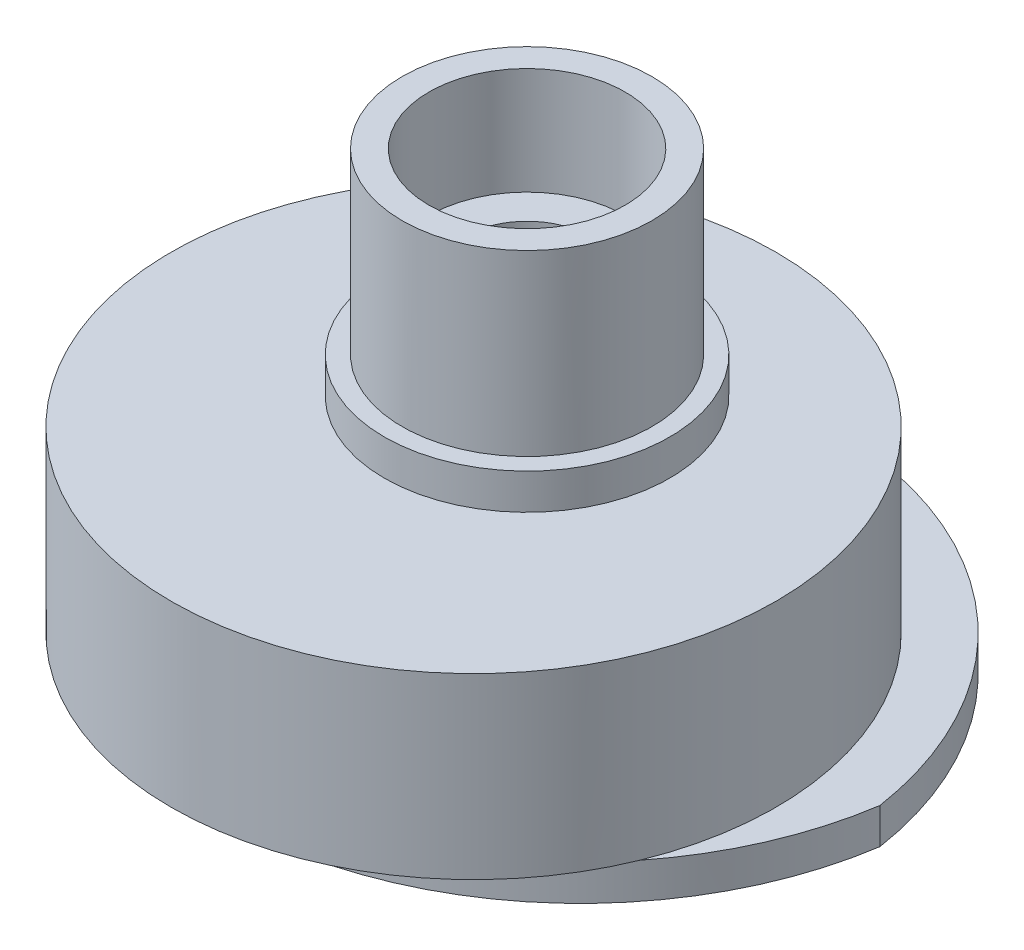
ISO-10303-21;
HEADER;
FILE_DESCRIPTION(('STEP AP214'),'2;1');
FILE_NAME('part.step','',(''),(''),'','','');
FILE_SCHEMA(('AUTOMOTIVE_DESIGN { 1 0 10303 214 1 1 1 1 }'));
ENDSEC;
DATA;
#1=APPLICATION_CONTEXT('core data for automotive mechanical design processes');
#2=APPLICATION_PROTOCOL_DEFINITION('international standard','automotive_design',2000,#1);
#3=PRODUCT_CONTEXT('',#1,'mechanical');
#4=PRODUCT('Part','Part','',(#3));
#5=PRODUCT_RELATED_PRODUCT_CATEGORY('part','',(#4));
#6=PRODUCT_DEFINITION_FORMATION('','',#4);
#7=PRODUCT_DEFINITION_CONTEXT('part definition',#1,'design');
#8=PRODUCT_DEFINITION('design','',#6,#7);
#9=PRODUCT_DEFINITION_SHAPE('','',#8);
#10=(LENGTH_UNIT() NAMED_UNIT(*) SI_UNIT(.MILLI.,.METRE.));
#11=(NAMED_UNIT(*) PLANE_ANGLE_UNIT() SI_UNIT($,.RADIAN.));
#12=(NAMED_UNIT(*) SI_UNIT($,.STERADIAN.) SOLID_ANGLE_UNIT());
#13=UNCERTAINTY_MEASURE_WITH_UNIT(LENGTH_MEASURE(1.E-05),#10,'distance_accuracy_value','');
#14=(GEOMETRIC_REPRESENTATION_CONTEXT(3) GLOBAL_UNCERTAINTY_ASSIGNED_CONTEXT((#13)) GLOBAL_UNIT_ASSIGNED_CONTEXT((#10,
#11,#12)) REPRESENTATION_CONTEXT('',''));
#15=CARTESIAN_POINT('',(0.,0.,0.));
#16=DIRECTION('',(0.,0.,1.));
#17=DIRECTION('',(1.,0.,0.));
#18=AXIS2_PLACEMENT_3D('',#15,#16,#17);
#19=CARTESIAN_POINT('',(0.,3.,0.));
#20=DIRECTION('',(0.,1.,0.));
#21=DIRECTION('',(0.,0.,1.));
#22=AXIS2_PLACEMENT_3D('',#19,#20,#21);
#23=PLANE('',#22);
#24=CARTESIAN_POINT('',(0.,3.,0.));
#25=DIRECTION('',(0.,1.,0.));
#26=DIRECTION('',(0.,0.,1.));
#27=AXIS2_PLACEMENT_3D('',#24,#25,#26);
#28=CIRCLE('',#27,3.5);
#29=CARTESIAN_POINT('',(0.,3.,3.5));
#30=VERTEX_POINT('',#29);
#31=EDGE_CURVE('E46',#30,#30,#28,.T.);
#32=ORIENTED_EDGE('',*,*,#31,.T.);
#33=EDGE_LOOP('',(#32));
#34=FACE_BOUND('',#33,.T.);
#35=CARTESIAN_POINT('',(0.,3.,0.));
#36=DIRECTION('',(0.,1.,0.));
#37=DIRECTION('',(0.,0.,1.));
#38=AXIS2_PLACEMENT_3D('',#35,#36,#37);
#39=CIRCLE('',#38,2.75);
#40=CARTESIAN_POINT('',(0.,3.,2.75));
#41=VERTEX_POINT('',#40);
#42=EDGE_CURVE('E170',#41,#41,#39,.T.);
#43=ORIENTED_EDGE('',*,*,#42,.F.);
#44=EDGE_LOOP('',(#43));
#45=FACE_BOUND('',#44,.T.);
#46=ADVANCED_FACE('F37',(#34,#45),#23,.T.);
#47=CARTESIAN_POINT('',(0.,3.,0.));
#48=DIRECTION('',(0.,-1.,0.));
#49=DIRECTION('',(0.,0.,-1.));
#50=AXIS2_PLACEMENT_3D('',#47,#48,#49);
#51=CYLINDRICAL_SURFACE('',#50,3.5);
#52=ORIENTED_EDGE('',*,*,#31,.F.);
#53=EDGE_LOOP('',(#52));
#54=FACE_BOUND('',#53,.T.);
#55=CARTESIAN_POINT('',(0.,-2.,0.));
#56=DIRECTION('',(0.,-1.,0.));
#57=DIRECTION('',(0.,0.,-1.));
#58=AXIS2_PLACEMENT_3D('',#55,#56,#57);
#59=CIRCLE('',#58,3.5);
#60=CARTESIAN_POINT('',(0.,-2.,-3.5));
#61=VERTEX_POINT('',#60);
#62=EDGE_CURVE('E166',#61,#61,#59,.T.);
#63=ORIENTED_EDGE('',*,*,#62,.F.);
#64=EDGE_LOOP('',(#63));
#65=FACE_BOUND('',#64,.T.);
#66=ADVANCED_FACE('F39',(#54,#65),#51,.T.);
#67=CARTESIAN_POINT('',(0.,3.,0.));
#68=DIRECTION('',(0.,-1.,0.));
#69=DIRECTION('',(0.,0.,-1.));
#70=AXIS2_PLACEMENT_3D('',#67,#68,#69);
#71=CYLINDRICAL_SURFACE('',#70,2.75);
#72=ORIENTED_EDGE('',*,*,#42,.T.);
#73=EDGE_LOOP('',(#72));
#74=FACE_BOUND('',#73,.T.);
#75=CARTESIAN_POINT('',(0.,0.,0.));
#76=DIRECTION('',(0.,1.,0.));
#77=DIRECTION('',(0.,0.,1.));
#78=AXIS2_PLACEMENT_3D('',#75,#76,#77);
#79=CIRCLE('',#78,2.75);
#80=CARTESIAN_POINT('',(0.,0.,2.75));
#81=VERTEX_POINT('',#80);
#82=EDGE_CURVE('E169',#81,#81,#79,.T.);
#83=ORIENTED_EDGE('',*,*,#82,.F.);
#84=EDGE_LOOP('',(#83));
#85=FACE_BOUND('',#84,.T.);
#86=ADVANCED_FACE('F181',(#74,#85),#71,.F.);
#87=CARTESIAN_POINT('',(0.,0.,0.));
#88=DIRECTION('',(0.,-1.,0.));
#89=DIRECTION('',(0.,0.,-1.));
#90=AXIS2_PLACEMENT_3D('',#87,#88,#89);
#91=PLANE('',#90);
#92=CARTESIAN_POINT('',(0.,0.,0.));
#93=DIRECTION('',(0.,-1.,0.));
#94=DIRECTION('',(0.,0.,-1.));
#95=AXIS2_PLACEMENT_3D('',#92,#93,#94);
#96=CIRCLE('',#95,1.75);
#97=CARTESIAN_POINT('',(0.,0.,-1.75));
#98=VERTEX_POINT('',#97);
#99=EDGE_CURVE('E161',#98,#98,#96,.T.);
#100=ORIENTED_EDGE('',*,*,#99,.T.);
#101=EDGE_LOOP('',(#100));
#102=FACE_BOUND('',#101,.T.);
#103=ORIENTED_EDGE('',*,*,#82,.T.);
#104=EDGE_LOOP('',(#103));
#105=FACE_BOUND('',#104,.T.);
#106=ADVANCED_FACE('F209',(#102,#105),#91,.F.);
#107=CARTESIAN_POINT('',(0.,-2.,0.));
#108=DIRECTION('',(0.,1.,0.));
#109=DIRECTION('',(0.,0.,1.));
#110=AXIS2_PLACEMENT_3D('',#107,#108,#109);
#111=CYLINDRICAL_SURFACE('',#110,1.75);
#112=CARTESIAN_POINT('',(0.,-4.,0.));
#113=DIRECTION('',(0.,1.,0.));
#114=DIRECTION('',(0.,0.,1.));
#115=AXIS2_PLACEMENT_3D('',#112,#113,#114);
#116=CIRCLE('',#115,1.75);
#117=CARTESIAN_POINT('',(0.,-4.,1.75));
#118=VERTEX_POINT('',#117);
#119=EDGE_CURVE('E41',#118,#118,#116,.T.);
#120=ORIENTED_EDGE('',*,*,#119,.F.);
#121=EDGE_LOOP('',(#120));
#122=FACE_BOUND('',#121,.T.);
#123=ORIENTED_EDGE('',*,*,#99,.F.);
#124=EDGE_LOOP('',(#123));
#125=FACE_BOUND('',#124,.T.);
#126=ADVANCED_FACE('F188',(#122,#125),#111,.F.);
#127=CARTESIAN_POINT('',(0.,-2.,0.));
#128=DIRECTION('',(0.,-1.,0.));
#129=DIRECTION('',(0.,0.,-1.));
#130=AXIS2_PLACEMENT_3D('',#127,#128,#129);
#131=PLANE('',#130);
#132=ORIENTED_EDGE('',*,*,#62,.T.);
#133=EDGE_LOOP('',(#132));
#134=FACE_BOUND('',#133,.T.);
#135=CARTESIAN_POINT('',(0.,-2.,0.));
#136=DIRECTION('',(0.,-1.,0.));
#137=DIRECTION('',(0.,0.,-1.));
#138=AXIS2_PLACEMENT_3D('',#135,#136,#137);
#139=CIRCLE('',#138,4.);
#140=CARTESIAN_POINT('',(0.,-2.,-4.));
#141=VERTEX_POINT('',#140);
#142=EDGE_CURVE('E154',#141,#141,#139,.T.);
#143=ORIENTED_EDGE('',*,*,#142,.F.);
#144=EDGE_LOOP('',(#143));
#145=FACE_BOUND('',#144,.T.);
#146=ADVANCED_FACE('F184',(#134,#145),#131,.F.);
#147=CARTESIAN_POINT('',(0.,-3.,0.));
#148=DIRECTION('',(0.,1.,0.));
#149=DIRECTION('',(0.,0.,1.));
#150=AXIS2_PLACEMENT_3D('',#147,#148,#149);
#151=CYLINDRICAL_SURFACE('',#150,4.);
#152=CARTESIAN_POINT('',(0.,-3.,0.));
#153=DIRECTION('',(0.,-1.,0.));
#154=DIRECTION('',(0.,0.,-1.));
#155=AXIS2_PLACEMENT_3D('',#152,#153,#154);
#156=CIRCLE('',#155,4.);
#157=CARTESIAN_POINT('',(0.,-3.,-4.));
#158=VERTEX_POINT('',#157);
#159=EDGE_CURVE('E158',#158,#158,#156,.T.);
#160=ORIENTED_EDGE('',*,*,#159,.F.);
#161=EDGE_LOOP('',(#160));
#162=FACE_BOUND('',#161,.T.);
#163=ORIENTED_EDGE('',*,*,#142,.T.);
#164=EDGE_LOOP('',(#163));
#165=FACE_BOUND('',#164,.T.);
#166=ADVANCED_FACE('F187',(#162,#165),#151,.T.);
#167=CARTESIAN_POINT('',(0.,-8.,1.5));
#168=DIRECTION('',(0.,-1.,0.));
#169=DIRECTION('',(0.,0.,-1.));
#170=AXIS2_PLACEMENT_3D('',#167,#168,#169);
#171=PLANE('',#170);
#172=CARTESIAN_POINT('',(0.,-8.,-1.5));
#173=DIRECTION('',(0.,-1.,0.));
#174=DIRECTION('',(0.,0.,-1.));
#175=AXIS2_PLACEMENT_3D('',#172,#173,#174);
#176=CIRCLE('',#175,10.);
#177=CARTESIAN_POINT('',(7.8493910651283,-8.,4.69572916666667));
#178=VERTEX_POINT('',#177);
#179=CARTESIAN_POINT('',(-7.8493910651283,-8.,4.69572916666667));
#180=VERTEX_POINT('',#179);
#181=EDGE_CURVE('E11',#178,#180,#176,.T.);
#182=ORIENTED_EDGE('',*,*,#181,.F.);
#183=CARTESIAN_POINT('',(0.,-8.,1.5));
#184=DIRECTION('',(0.,-1.,0.));
#185=DIRECTION('',(0.,0.,-1.));
#186=AXIS2_PLACEMENT_3D('',#183,#184,#185);
#187=CIRCLE('',#186,8.475);
#188=EDGE_CURVE('E152',#178,#180,#187,.T.);
#189=ORIENTED_EDGE('',*,*,#188,.T.);
#190=EDGE_LOOP('',(#182,#189));
#191=FACE_BOUND('',#190,.T.);
#192=ADVANCED_FACE('F193',(#191),#171,.T.);
#193=CARTESIAN_POINT('',(0.,-3.,1.5));
#194=DIRECTION('',(0.,-1.,0.));
#195=DIRECTION('',(0.,0.,-1.));
#196=AXIS2_PLACEMENT_3D('',#193,#194,#195);
#197=PLANE('',#196);
#198=ORIENTED_EDGE('',*,*,#159,.T.);
#199=EDGE_LOOP('',(#198));
#200=FACE_BOUND('',#199,.T.);
#201=CARTESIAN_POINT('',(0.,-3.,1.5));
#202=DIRECTION('',(0.,-1.,0.));
#203=DIRECTION('',(0.,0.,-1.));
#204=AXIS2_PLACEMENT_3D('',#201,#202,#203);
#205=CIRCLE('',#204,8.475);
#206=CARTESIAN_POINT('',(0.,-3.,-6.975));
#207=VERTEX_POINT('',#206);
#208=EDGE_CURVE('E151',#207,#207,#205,.T.);
#209=ORIENTED_EDGE('',*,*,#208,.F.);
#210=EDGE_LOOP('',(#209));
#211=FACE_BOUND('',#210,.T.);
#212=ADVANCED_FACE('F199',(#200,#211),#197,.F.);
#213=CARTESIAN_POINT('',(0.,-8.,1.5));
#214=DIRECTION('',(0.,1.,0.));
#215=DIRECTION('',(0.,0.,1.));
#216=AXIS2_PLACEMENT_3D('',#213,#214,#215);
#217=CYLINDRICAL_SURFACE('',#216,8.475);
#218=ORIENTED_EDGE('',*,*,#188,.F.);
#219=EDGE_CURVE('E155',#180,#178,#187,.T.);
#220=ORIENTED_EDGE('',*,*,#219,.F.);
#221=EDGE_LOOP('',(#218,#220));
#222=FACE_BOUND('',#221,.T.);
#223=ORIENTED_EDGE('',*,*,#208,.T.);
#224=EDGE_LOOP('',(#223));
#225=FACE_BOUND('',#224,.T.);
#226=ADVANCED_FACE('F251',(#222,#225),#217,.T.);
#227=CARTESIAN_POINT('',(0.,-8.,0.));
#228=DIRECTION('',(0.,-1.,0.));
#229=DIRECTION('',(0.,0.,-1.));
#230=AXIS2_PLACEMENT_3D('',#227,#228,#229);
#231=PLANE('',#230);
#232=CARTESIAN_POINT('',(-9.88685996664259,-8.,0.));
#233=VERTEX_POINT('',#232);
#234=EDGE_CURVE('E49',#180,#233,#176,.T.);
#235=ORIENTED_EDGE('',*,*,#234,.F.);
#236=ORIENTED_EDGE('',*,*,#219,.T.);
#237=CARTESIAN_POINT('',(9.88685996664259,-8.,0.));
#238=VERTEX_POINT('',#237);
#239=EDGE_CURVE('E48',#238,#178,#176,.T.);
#240=ORIENTED_EDGE('',*,*,#239,.F.);
#241=CARTESIAN_POINT('',(0.,-8.,1.5));
#242=DIRECTION('',(0.,-1.,0.));
#243=DIRECTION('',(0.,0.,-1.));
#244=AXIS2_PLACEMENT_3D('',#241,#242,#243);
#245=CIRCLE('',#244,10.);
#246=EDGE_CURVE('E142',#233,#238,#245,.T.);
#247=ORIENTED_EDGE('',*,*,#246,.F.);
#248=EDGE_LOOP('',(#235,#236,#240,#247));
#249=FACE_BOUND('',#248,.T.);
#250=ADVANCED_FACE('F247',(#249),#231,.F.);
#251=CARTESIAN_POINT('',(0.,-9.,0.));
#252=DIRECTION('',(0.,-1.,0.));
#253=DIRECTION('',(0.,0.,-1.));
#254=AXIS2_PLACEMENT_3D('',#251,#252,#253);
#255=PLANE('',#254);
#256=DIRECTION('',(0.,0.,1.));
#257=VECTOR('',#256,1.);
#258=CARTESIAN_POINT('',(4.65,-9.,-3.15));
#259=LINE('',#258,#257);
#260=CARTESIAN_POINT('',(4.65,-9.,-3.15));
#261=VERTEX_POINT('',#260);
#262=CARTESIAN_POINT('',(4.65,-9.,3.15));
#263=VERTEX_POINT('',#262);
#264=EDGE_CURVE('E56',#261,#263,#259,.T.);
#265=ORIENTED_EDGE('',*,*,#264,.F.);
#266=DIRECTION('',(1.,0.,0.));
#267=VECTOR('',#266,1.);
#268=CARTESIAN_POINT('',(-4.65,-9.,-3.15));
#269=LINE('',#268,#267);
#270=CARTESIAN_POINT('',(-4.65,-9.,-3.15));
#271=VERTEX_POINT('',#270);
#272=EDGE_CURVE('E118',#271,#261,#269,.T.);
#273=ORIENTED_EDGE('',*,*,#272,.F.);
#274=DIRECTION('',(0.,0.,-1.));
#275=VECTOR('',#274,1.);
#276=CARTESIAN_POINT('',(-4.65,-9.,-3.15));
#277=LINE('',#276,#275);
#278=CARTESIAN_POINT('',(-4.65,-9.,3.15));
#279=VERTEX_POINT('',#278);
#280=EDGE_CURVE('E121',#279,#271,#277,.T.);
#281=ORIENTED_EDGE('',*,*,#280,.F.);
#282=DIRECTION('',(-1.,0.,0.));
#283=VECTOR('',#282,1.);
#284=CARTESIAN_POINT('',(-4.65,-9.,3.15));
#285=LINE('',#284,#283);
#286=EDGE_CURVE('E127',#263,#279,#285,.T.);
#287=ORIENTED_EDGE('',*,*,#286,.F.);
#288=EDGE_LOOP('',(#265,#273,#281,#287));
#289=FACE_BOUND('',#288,.T.);
#290=CARTESIAN_POINT('',(0.,-9.,1.5));
#291=DIRECTION('',(0.,-1.,0.));
#292=DIRECTION('',(0.,0.,-1.));
#293=AXIS2_PLACEMENT_3D('',#290,#291,#292);
#294=CIRCLE('',#293,10.);
#295=CARTESIAN_POINT('',(-9.88685996664259,-9.,0.));
#296=VERTEX_POINT('',#295);
#297=CARTESIAN_POINT('',(9.88685996664259,-9.,0.));
#298=VERTEX_POINT('',#297);
#299=EDGE_CURVE('E136',#296,#298,#294,.T.);
#300=ORIENTED_EDGE('',*,*,#299,.T.);
#301=CARTESIAN_POINT('',(0.,-9.,-1.5));
#302=DIRECTION('',(0.,-1.,0.));
#303=DIRECTION('',(0.,0.,-1.));
#304=AXIS2_PLACEMENT_3D('',#301,#302,#303);
#305=CIRCLE('',#304,10.);
#306=EDGE_CURVE('E139',#298,#296,#305,.T.);
#307=ORIENTED_EDGE('',*,*,#306,.T.);
#308=EDGE_LOOP('',(#300,#307));
#309=FACE_BOUND('',#308,.T.);
#310=ADVANCED_FACE('F243',(#289,#309),#255,.T.);
#311=CARTESIAN_POINT('',(0.,-9.,1.5));
#312=DIRECTION('',(0.,1.,0.));
#313=DIRECTION('',(0.,0.,1.));
#314=AXIS2_PLACEMENT_3D('',#311,#312,#313);
#315=CYLINDRICAL_SURFACE('',#314,10.);
#316=ORIENTED_EDGE('',*,*,#246,.T.);
#317=DIRECTION('',(0.,1.,0.));
#318=VECTOR('',#317,1.);
#319=CARTESIAN_POINT('',(9.88685996664259,-9.,0.));
#320=LINE('',#319,#318);
#321=EDGE_CURVE('E148',#298,#238,#320,.T.);
#322=ORIENTED_EDGE('',*,*,#321,.F.);
#323=ORIENTED_EDGE('',*,*,#299,.F.);
#324=DIRECTION('',(0.,1.,0.));
#325=VECTOR('',#324,1.);
#326=CARTESIAN_POINT('',(-9.88685996664259,-9.,0.));
#327=LINE('',#326,#325);
#328=EDGE_CURVE('E141',#296,#233,#327,.T.);
#329=ORIENTED_EDGE('',*,*,#328,.T.);
#330=EDGE_LOOP('',(#316,#322,#323,#329));
#331=FACE_BOUND('',#330,.T.);
#332=ADVANCED_FACE('F246',(#331),#315,.T.);
#333=CARTESIAN_POINT('',(0.,-9.,-1.5));
#334=DIRECTION('',(0.,1.,0.));
#335=DIRECTION('',(0.,0.,1.));
#336=AXIS2_PLACEMENT_3D('',#333,#334,#335);
#337=CYLINDRICAL_SURFACE('',#336,10.);
#338=ORIENTED_EDGE('',*,*,#239,.T.);
#339=ORIENTED_EDGE('',*,*,#181,.T.);
#340=ORIENTED_EDGE('',*,*,#234,.T.);
#341=ORIENTED_EDGE('',*,*,#328,.F.);
#342=ORIENTED_EDGE('',*,*,#306,.F.);
#343=ORIENTED_EDGE('',*,*,#321,.T.);
#344=EDGE_LOOP('',(#338,#339,#340,#341,#342,#343));
#345=FACE_BOUND('',#344,.T.);
#346=ADVANCED_FACE('F242',(#345),#337,.T.);
#347=CARTESIAN_POINT('',(4.65,-4.,-3.15));
#348=DIRECTION('',(1.,0.,0.));
#349=DIRECTION('',(0.,0.,-1.));
#350=AXIS2_PLACEMENT_3D('',#347,#348,#349);
#351=PLANE('',#350);
#352=ORIENTED_EDGE('',*,*,#264,.T.);
#353=DIRECTION('',(0.,-1.,0.));
#354=VECTOR('',#353,1.);
#355=CARTESIAN_POINT('',(4.65,-4.,3.15));
#356=LINE('',#355,#354);
#357=CARTESIAN_POINT('',(4.65,-4.,3.15));
#358=VERTEX_POINT('',#357);
#359=EDGE_CURVE('E96',#358,#263,#356,.T.);
#360=ORIENTED_EDGE('',*,*,#359,.F.);
#361=DIRECTION('',(0.,0.,1.));
#362=VECTOR('',#361,1.);
#363=CARTESIAN_POINT('',(4.65,-4.,-3.15));
#364=LINE('',#363,#362);
#365=CARTESIAN_POINT('',(4.65,-4.,-3.15));
#366=VERTEX_POINT('',#365);
#367=EDGE_CURVE('E100',#366,#358,#364,.T.);
#368=ORIENTED_EDGE('',*,*,#367,.F.);
#369=DIRECTION('',(0.,-1.,0.));
#370=VECTOR('',#369,1.);
#371=CARTESIAN_POINT('',(4.65,-4.,-3.15));
#372=LINE('',#371,#370);
#373=EDGE_CURVE('E131',#366,#261,#372,.T.);
#374=ORIENTED_EDGE('',*,*,#373,.T.);
#375=EDGE_LOOP('',(#352,#360,#368,#374));
#376=FACE_BOUND('',#375,.T.);
#377=ADVANCED_FACE('F98',(#376),#351,.F.);
#378=CARTESIAN_POINT('',(-4.65,-4.,-3.15));
#379=DIRECTION('',(0.,0.,-1.));
#380=DIRECTION('',(-1.,0.,0.));
#381=AXIS2_PLACEMENT_3D('',#378,#379,#380);
#382=PLANE('',#381);
#383=ORIENTED_EDGE('',*,*,#272,.T.);
#384=ORIENTED_EDGE('',*,*,#373,.F.);
#385=DIRECTION('',(1.,0.,0.));
#386=VECTOR('',#385,1.);
#387=CARTESIAN_POINT('',(-4.65,-4.,-3.15));
#388=LINE('',#387,#386);
#389=CARTESIAN_POINT('',(-4.65,-4.,-3.15));
#390=VERTEX_POINT('',#389);
#391=EDGE_CURVE('E106',#390,#366,#388,.T.);
#392=ORIENTED_EDGE('',*,*,#391,.F.);
#393=DIRECTION('',(0.,-1.,0.));
#394=VECTOR('',#393,1.);
#395=CARTESIAN_POINT('',(-4.65,-4.,-3.15));
#396=LINE('',#395,#394);
#397=EDGE_CURVE('E133',#390,#271,#396,.T.);
#398=ORIENTED_EDGE('',*,*,#397,.T.);
#399=EDGE_LOOP('',(#383,#384,#392,#398));
#400=FACE_BOUND('',#399,.T.);
#401=ADVANCED_FACE('F233',(#400),#382,.F.);
#402=CARTESIAN_POINT('',(-4.65,-4.,-3.15));
#403=DIRECTION('',(-1.,0.,0.));
#404=DIRECTION('',(0.,0.,1.));
#405=AXIS2_PLACEMENT_3D('',#402,#403,#404);
#406=PLANE('',#405);
#407=ORIENTED_EDGE('',*,*,#280,.T.);
#408=ORIENTED_EDGE('',*,*,#397,.F.);
#409=DIRECTION('',(0.,0.,-1.));
#410=VECTOR('',#409,1.);
#411=CARTESIAN_POINT('',(-4.65,-4.,-3.15));
#412=LINE('',#411,#410);
#413=CARTESIAN_POINT('',(-4.65,-4.,3.15));
#414=VERTEX_POINT('',#413);
#415=EDGE_CURVE('E114',#414,#390,#412,.T.);
#416=ORIENTED_EDGE('',*,*,#415,.F.);
#417=DIRECTION('',(0.,-1.,0.));
#418=VECTOR('',#417,1.);
#419=CARTESIAN_POINT('',(-4.65,-4.,3.15));
#420=LINE('',#419,#418);
#421=EDGE_CURVE('E105',#414,#279,#420,.T.);
#422=ORIENTED_EDGE('',*,*,#421,.T.);
#423=EDGE_LOOP('',(#407,#408,#416,#422));
#424=FACE_BOUND('',#423,.T.);
#425=ADVANCED_FACE('F230',(#424),#406,.F.);
#426=CARTESIAN_POINT('',(-4.65,-4.,3.15));
#427=DIRECTION('',(0.,0.,1.));
#428=DIRECTION('',(1.,0.,0.));
#429=AXIS2_PLACEMENT_3D('',#426,#427,#428);
#430=PLANE('',#429);
#431=ORIENTED_EDGE('',*,*,#286,.T.);
#432=ORIENTED_EDGE('',*,*,#421,.F.);
#433=DIRECTION('',(-1.,0.,0.));
#434=VECTOR('',#433,1.);
#435=CARTESIAN_POINT('',(-4.65,-4.,3.15));
#436=LINE('',#435,#434);
#437=EDGE_CURVE('E109',#358,#414,#436,.T.);
#438=ORIENTED_EDGE('',*,*,#437,.F.);
#439=ORIENTED_EDGE('',*,*,#359,.T.);
#440=EDGE_LOOP('',(#431,#432,#438,#439));
#441=FACE_BOUND('',#440,.T.);
#442=ADVANCED_FACE('F110',(#441),#430,.F.);
#443=CARTESIAN_POINT('',(0.,-4.,0.));
#444=DIRECTION('',(0.,1.,0.));
#445=DIRECTION('',(0.,0.,1.));
#446=AXIS2_PLACEMENT_3D('',#443,#444,#445);
#447=PLANE('',#446);
#448=ORIENTED_EDGE('',*,*,#119,.T.);
#449=EDGE_LOOP('',(#448));
#450=FACE_BOUND('',#449,.T.);
#451=ORIENTED_EDGE('',*,*,#367,.T.);
#452=ORIENTED_EDGE('',*,*,#437,.T.);
#453=ORIENTED_EDGE('',*,*,#415,.T.);
#454=ORIENTED_EDGE('',*,*,#391,.T.);
#455=EDGE_LOOP('',(#451,#452,#453,#454));
#456=FACE_BOUND('',#455,.T.);
#457=ADVANCED_FACE('F116',(#450,#456),#447,.F.);
#458=CLOSED_SHELL('',(#46,#66,#86,#106,#126,#146,#166,#192,#212,#226,#250,#310,#332,#346,#377,
#401,#425,#442,#457));
#459=MANIFOLD_SOLID_BREP('B2',#458);
#460=ADVANCED_BREP_SHAPE_REPRESENTATION('',(#18,#459),#14);
#461=SHAPE_DEFINITION_REPRESENTATION(#9,#460);
ENDSEC;
END-ISO-10303-21;
